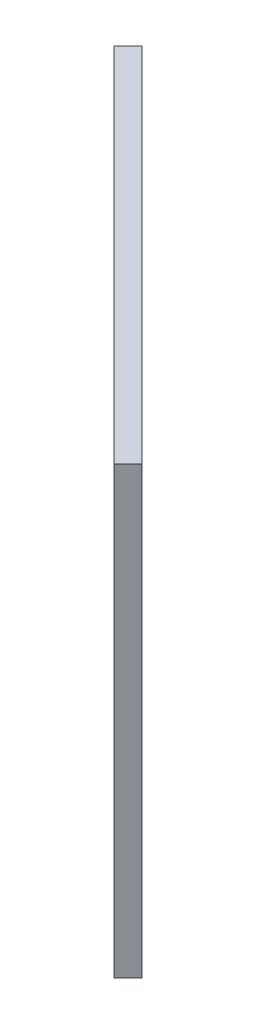
ISO-10303-21;
HEADER;
FILE_DESCRIPTION(('STEP AP214'),'2;1');
FILE_NAME('part.step','',(''),(''),'','','');
FILE_SCHEMA(('AUTOMOTIVE_DESIGN { 1 0 10303 214 1 1 1 1 }'));
ENDSEC;
DATA;
#1=APPLICATION_CONTEXT('core data for automotive mechanical design processes');
#2=APPLICATION_PROTOCOL_DEFINITION('international standard','automotive_design',2000,#1);
#3=PRODUCT_CONTEXT('',#1,'mechanical');
#4=PRODUCT('Part','Part','',(#3));
#5=PRODUCT_RELATED_PRODUCT_CATEGORY('part','',(#4));
#6=PRODUCT_DEFINITION_FORMATION('','',#4);
#7=PRODUCT_DEFINITION_CONTEXT('part definition',#1,'design');
#8=PRODUCT_DEFINITION('design','',#6,#7);
#9=PRODUCT_DEFINITION_SHAPE('','',#8);
#10=(LENGTH_UNIT() NAMED_UNIT(*) SI_UNIT(.MILLI.,.METRE.));
#11=(NAMED_UNIT(*) PLANE_ANGLE_UNIT() SI_UNIT($,.RADIAN.));
#12=(NAMED_UNIT(*) SI_UNIT($,.STERADIAN.) SOLID_ANGLE_UNIT());
#13=UNCERTAINTY_MEASURE_WITH_UNIT(LENGTH_MEASURE(1.E-05),#10,'distance_accuracy_value','');
#14=(GEOMETRIC_REPRESENTATION_CONTEXT(3) GLOBAL_UNCERTAINTY_ASSIGNED_CONTEXT((#13)) GLOBAL_UNIT_ASSIGNED_CONTEXT((#10,
#11,#12)) REPRESENTATION_CONTEXT('',''));
#15=CARTESIAN_POINT('',(0.,0.,0.));
#16=DIRECTION('',(0.,0.,1.));
#17=DIRECTION('',(1.,0.,0.));
#18=AXIS2_PLACEMENT_3D('',#15,#16,#17);
#19=CARTESIAN_POINT('',(5126.5684024777,40605.2777383533,-5126.56840247746));
#20=DIRECTION('',(0.,1.,0.));
#21=DIRECTION('',(0.,0.,1.));
#22=AXIS2_PLACEMENT_3D('',#19,#20,#21);
#23=PLANE('',#22);
#24=DIRECTION('',(-0.707106781186534,0.,-0.707106781186561));
#25=VECTOR('',#24,1.);
#26=CARTESIAN_POINT('',(5147.78160591336,40605.2777383533,-5147.78160591312));
#27=LINE('',#26,#25);
#28=CARTESIAN_POINT('',(-11231.5402348683,40605.2777383533,-21527.1034466954));
#29=VERTEX_POINT('',#28);
#30=CARTESIAN_POINT('',(-11337.6062520462,40605.2777383533,-21633.1694638734));
#31=VERTEX_POINT('',#30);
#32=EDGE_CURVE('E2017',#29,#31,#27,.T.);
#33=ORIENTED_EDGE('',*,*,#32,.F.);
#34=DIRECTION('',(0.707106781186561,0.,-0.707106781186534));
#35=VECTOR('',#34,1.);
#36=CARTESIAN_POINT('',(-11252.7534383039,40605.2777383533,-21505.8902432598));
#37=LINE('',#36,#35);
#38=CARTESIAN_POINT('',(-11235.0757687743,40605.2777383533,-21523.5679127893));
#39=VERTEX_POINT('',#38);
#40=EDGE_CURVE('E2130',#39,#29,#37,.T.);
#41=ORIENTED_EDGE('',*,*,#40,.F.);
#42=DIRECTION('',(-0.707106781186541,0.,-0.707106781186554));
#43=VECTOR('',#42,1.);
#44=CARTESIAN_POINT('',(5144.24607200736,40605.2777383533,-5144.24607200726));
#45=LINE('',#44,#43);
#46=CARTESIAN_POINT('',(-11341.1417859523,40605.2777383533,-21629.6339299673));
#47=VERTEX_POINT('',#46);
#48=EDGE_CURVE('E2002',#39,#47,#45,.T.);
#49=ORIENTED_EDGE('',*,*,#48,.T.);
#50=DIRECTION('',(0.707106781186561,0.,-0.707106781186534));
#51=VECTOR('',#50,1.);
#52=CARTESIAN_POINT('',(-11358.8194554818,40605.2777383533,-21611.9562604378));
#53=LINE('',#52,#51);
#54=EDGE_CURVE('E2131',#47,#31,#53,.T.);
#55=ORIENTED_EDGE('',*,*,#54,.T.);
#56=EDGE_LOOP('',(#33,#41,#49,#55));
#57=FACE_BOUND('',#56,.T.);
#58=ADVANCED_FACE('F1993',(#57),#23,.F.);
#59=CARTESIAN_POINT('',(-11252.7534383038,40601.9277383533,-21505.8902432598));
#60=DIRECTION('',(0.707106781186561,0.,-0.707106781186534));
#61=DIRECTION('',(-0.707106781186534,0.,-0.707106781186561));
#62=AXIS2_PLACEMENT_3D('',#59,#60,#61);
#63=CYLINDRICAL_SURFACE('',#62,3.34999999999752);
#64=CARTESIAN_POINT('',(-11231.5402348682,40601.9277383533,-21527.1034466954));
#65=DIRECTION('',(0.707106781186561,0.,-0.707106781186534));
#66=DIRECTION('',(-0.707106781186534,0.,-0.707106781186561));
#67=AXIS2_PLACEMENT_3D('',#64,#65,#66);
#68=CIRCLE('',#67,3.34999999999752);
#69=CARTESIAN_POINT('',(-11231.5402348683,40598.5777383533,-21527.1034466954));
#70=VERTEX_POINT('',#69);
#71=EDGE_CURVE('E2127',#70,#29,#68,.F.);
#72=ORIENTED_EDGE('',*,*,#71,.F.);
#73=DIRECTION('',(0.707106781186561,0.,-0.707106781186534));
#74=VECTOR('',#73,1.);
#75=CARTESIAN_POINT('',(-11252.7534383039,40598.5777383533,-21505.8902432598));
#76=LINE('',#75,#74);
#77=CARTESIAN_POINT('',(-11235.0757687743,40598.5777383533,-21523.5679127893));
#78=VERTEX_POINT('',#77);
#79=EDGE_CURVE('E2138',#78,#70,#76,.T.);
#80=ORIENTED_EDGE('',*,*,#79,.F.);
#81=CARTESIAN_POINT('',(-11235.0757687743,40601.9277383533,-21523.5679127893));
#82=DIRECTION('',(-0.707106781186555,0.,0.707106781186541));
#83=DIRECTION('',(0.707106781186541,0.,0.707106781186554));
#84=AXIS2_PLACEMENT_3D('',#81,#82,#83);
#85=CIRCLE('',#84,3.34999999999752);
#86=EDGE_CURVE('E2177',#78,#39,#85,.T.);
#87=ORIENTED_EDGE('',*,*,#86,.T.);
#88=ORIENTED_EDGE('',*,*,#40,.T.);
#89=EDGE_LOOP('',(#72,#80,#87,#88));
#90=FACE_BOUND('',#89,.T.);
#91=ADVANCED_FACE('F2231',(#90),#63,.F.);
#92=CARTESIAN_POINT('',(5126.5684024777,40598.5777383533,-5126.56840247746));
#93=DIRECTION('',(0.,1.,0.));
#94=DIRECTION('',(0.,0.,1.));
#95=AXIS2_PLACEMENT_3D('',#92,#93,#94);
#96=PLANE('',#95);
#97=ORIENTED_EDGE('',*,*,#79,.T.);
#98=DIRECTION('',(-0.707106781186534,0.,-0.707106781186561));
#99=VECTOR('',#98,1.);
#100=CARTESIAN_POINT('',(5147.78160591336,40598.5777383533,-5147.78160591312));
#101=LINE('',#100,#99);
#102=CARTESIAN_POINT('',(-11337.6062520462,40598.5777383533,-21633.1694638734));
#103=VERTEX_POINT('',#102);
#104=EDGE_CURVE('E2121',#70,#103,#101,.T.);
#105=ORIENTED_EDGE('',*,*,#104,.T.);
#106=DIRECTION('',(0.707106781186561,0.,-0.707106781186534));
#107=VECTOR('',#106,1.);
#108=CARTESIAN_POINT('',(-11358.8194554818,40598.5777383533,-21611.9562604378));
#109=LINE('',#108,#107);
#110=CARTESIAN_POINT('',(-11341.1417859523,40598.5777383533,-21629.6339299673));
#111=VERTEX_POINT('',#110);
#112=EDGE_CURVE('E2135',#111,#103,#109,.T.);
#113=ORIENTED_EDGE('',*,*,#112,.F.);
#114=DIRECTION('',(-0.707106781186541,0.,-0.707106781186554));
#115=VECTOR('',#114,1.);
#116=CARTESIAN_POINT('',(5144.24607200736,40598.5777383533,-5144.24607200726));
#117=LINE('',#116,#115);
#118=EDGE_CURVE('E2174',#78,#111,#117,.T.);
#119=ORIENTED_EDGE('',*,*,#118,.F.);
#120=EDGE_LOOP('',(#97,#105,#113,#119));
#121=FACE_BOUND('',#120,.T.);
#122=ADVANCED_FACE('F2237',(#121),#96,.T.);
#123=CARTESIAN_POINT('',(-11358.8194554818,40601.9277383533,-21611.9562604378));
#124=DIRECTION('',(0.707106781186561,0.,-0.707106781186534));
#125=DIRECTION('',(-0.707106781186534,0.,-0.707106781186561));
#126=AXIS2_PLACEMENT_3D('',#123,#124,#125);
#127=CYLINDRICAL_SURFACE('',#126,3.34999999999752);
#128=CARTESIAN_POINT('',(-11337.6062520462,40601.9277383533,-21633.1694638734));
#129=DIRECTION('',(0.707106781186561,0.,-0.707106781186534));
#130=DIRECTION('',(-0.707106781186534,0.,-0.707106781186561));
#131=AXIS2_PLACEMENT_3D('',#128,#129,#130);
#132=CIRCLE('',#131,3.34999999999752);
#133=EDGE_CURVE('E12',#31,#103,#132,.F.);
#134=ORIENTED_EDGE('',*,*,#133,.F.);
#135=ORIENTED_EDGE('',*,*,#54,.F.);
#136=CARTESIAN_POINT('',(-11341.1417859523,40601.9277383533,-21629.6339299673));
#137=DIRECTION('',(-0.707106781186555,0.,0.707106781186541));
#138=DIRECTION('',(0.707106781186541,0.,0.707106781186554));
#139=AXIS2_PLACEMENT_3D('',#136,#137,#138);
#140=CIRCLE('',#139,3.34999999999752);
#141=EDGE_CURVE('E2172',#47,#111,#140,.T.);
#142=ORIENTED_EDGE('',*,*,#141,.T.);
#143=ORIENTED_EDGE('',*,*,#112,.T.);
#144=EDGE_LOOP('',(#134,#135,#142,#143));
#145=FACE_BOUND('',#144,.T.);
#146=ADVANCED_FACE('F2243',(#145),#127,.F.);
#147=CARTESIAN_POINT('',(-11372.7759132726,40621.9277383533,-21675.4101929113));
#148=DIRECTION('',(0.707106781186541,0.,0.707106781186554));
#149=DIRECTION('',(0.707106781186554,0.,-0.707106781186541));
#150=AXIS2_PLACEMENT_3D('',#147,#148,#149);
#151=PLANE('',#150);
#152=DIRECTION('',(0.,1.,0.));
#153=VECTOR('',#152,1.);
#154=CARTESIAN_POINT('',(-11379.8469810845,40621.9277383533,-21668.3391250994));
#155=LINE('',#154,#153);
#156=CARTESIAN_POINT('',(-11379.8469810845,40398.2797239448,-21668.3391250994));
#157=VERTEX_POINT('',#156);
#158=CARTESIAN_POINT('',(-11379.8469810845,40621.9277383533,-21668.3391250994));
#159=VERTEX_POINT('',#158);
#160=EDGE_CURVE('E2134',#157,#159,#155,.T.);
#161=ORIENTED_EDGE('',*,*,#160,.T.);
#162=DIRECTION('',(-0.707106781186554,0.,0.707106781186541));
#163=VECTOR('',#162,1.);
#164=CARTESIAN_POINT('',(-11372.7759132726,40621.9277383533,-21675.4101929113));
#165=LINE('',#164,#163);
#166=CARTESIAN_POINT('',(-11372.7759132726,40621.9277383533,-21675.4101929113));
#167=VERTEX_POINT('',#166);
#168=EDGE_CURVE('E2169',#167,#159,#165,.T.);
#169=ORIENTED_EDGE('',*,*,#168,.F.);
#170=DIRECTION('',(0.,1.,0.));
#171=VECTOR('',#170,1.);
#172=CARTESIAN_POINT('',(-11372.7759132726,40621.9277383533,-21675.4101929113));
#173=LINE('',#172,#171);
#174=CARTESIAN_POINT('',(-11372.7759132726,40398.2797239448,-21675.4101929113));
#175=VERTEX_POINT('',#174);
#176=EDGE_CURVE('E2143',#175,#167,#173,.T.);
#177=ORIENTED_EDGE('',*,*,#176,.F.);
#178=DIRECTION('',(-0.707106781186554,0.,0.707106781186541));
#179=VECTOR('',#178,1.);
#180=CARTESIAN_POINT('',(-11372.7759132726,40398.2797239448,-21675.4101929113));
#181=LINE('',#180,#179);
#182=EDGE_CURVE('E2153',#175,#157,#181,.T.);
#183=ORIENTED_EDGE('',*,*,#182,.T.);
#184=EDGE_LOOP('',(#161,#169,#177,#183));
#185=FACE_BOUND('',#184,.T.);
#186=ADVANCED_FACE('F1995',(#185),#151,.F.);
#187=CARTESIAN_POINT('',(-11372.7759132726,40621.9277383533,-21675.4101929113));
#188=DIRECTION('',(0.,-1.,0.));
#189=DIRECTION('',(1.,0.,0.));
#190=AXIS2_PLACEMENT_3D('',#187,#188,#189);
#191=PLANE('',#190);
#192=DIRECTION('',(0.707106781186541,0.,0.707106781186554));
#193=VECTOR('',#192,1.);
#194=CARTESIAN_POINT('',(-11379.8469810845,40621.9277383533,-21668.3391250994));
#195=LINE('',#194,#193);
#196=CARTESIAN_POINT('',(-11198.1145610634,40621.9277383533,-21486.6067050783));
#197=VERTEX_POINT('',#196);
#198=EDGE_CURVE('E2156',#159,#197,#195,.T.);
#199=ORIENTED_EDGE('',*,*,#198,.T.);
#200=DIRECTION('',(-0.707106781186554,0.,0.707106781186541));
#201=VECTOR('',#200,1.);
#202=CARTESIAN_POINT('',(-11191.0434932515,40621.9277383533,-21493.6777728902));
#203=LINE('',#202,#201);
#204=CARTESIAN_POINT('',(-11191.0434932515,40621.9277383533,-21493.6777728902));
#205=VERTEX_POINT('',#204);
#206=EDGE_CURVE('E2166',#205,#197,#203,.T.);
#207=ORIENTED_EDGE('',*,*,#206,.F.);
#208=DIRECTION('',(0.707106781186541,0.,0.707106781186554));
#209=VECTOR('',#208,1.);
#210=CARTESIAN_POINT('',(-11372.7759132726,40621.9277383533,-21675.4101929113));
#211=LINE('',#210,#209);
#212=EDGE_CURVE('E2146',#167,#205,#211,.T.);
#213=ORIENTED_EDGE('',*,*,#212,.F.);
#214=ORIENTED_EDGE('',*,*,#168,.T.);
#215=EDGE_LOOP('',(#199,#207,#213,#214));
#216=FACE_BOUND('',#215,.T.);
#217=ADVANCED_FACE('F2211',(#216),#191,.F.);
#218=CARTESIAN_POINT('',(-11191.0434932515,40621.9277383533,-21493.6777728902));
#219=DIRECTION('',(-0.707106781186541,0.,-0.707106781186554));
#220=DIRECTION('',(-0.707106781186554,0.,0.707106781186541));
#221=AXIS2_PLACEMENT_3D('',#218,#219,#220);
#222=PLANE('',#221);
#223=DIRECTION('',(0.,-1.,0.));
#224=VECTOR('',#223,1.);
#225=CARTESIAN_POINT('',(-11198.1145610634,40621.9277383533,-21486.6067050783));
#226=LINE('',#225,#224);
#227=CARTESIAN_POINT('',(-11198.1145610634,40398.2797239448,-21486.6067050783));
#228=VERTEX_POINT('',#227);
#229=EDGE_CURVE('E2158',#197,#228,#226,.T.);
#230=ORIENTED_EDGE('',*,*,#229,.T.);
#231=DIRECTION('',(-0.707106781186554,0.,0.707106781186541));
#232=VECTOR('',#231,1.);
#233=CARTESIAN_POINT('',(-11191.0434932515,40398.2797239448,-21493.6777728902));
#234=LINE('',#233,#232);
#235=CARTESIAN_POINT('',(-11191.0434932515,40398.2797239448,-21493.6777728902));
#236=VERTEX_POINT('',#235);
#237=EDGE_CURVE('E2163',#236,#228,#234,.T.);
#238=ORIENTED_EDGE('',*,*,#237,.F.);
#239=DIRECTION('',(0.,-1.,0.));
#240=VECTOR('',#239,1.);
#241=CARTESIAN_POINT('',(-11191.0434932515,40621.9277383533,-21493.6777728902));
#242=LINE('',#241,#240);
#243=EDGE_CURVE('E2149',#205,#236,#242,.T.);
#244=ORIENTED_EDGE('',*,*,#243,.F.);
#245=ORIENTED_EDGE('',*,*,#206,.T.);
#246=EDGE_LOOP('',(#230,#238,#244,#245));
#247=FACE_BOUND('',#246,.T.);
#248=ADVANCED_FACE('F2216',(#247),#222,.F.);
#249=CARTESIAN_POINT('',(-11372.7759132726,40398.2797239448,-21675.4101929113));
#250=DIRECTION('',(0.,1.,0.));
#251=DIRECTION('',(-1.,0.,0.));
#252=AXIS2_PLACEMENT_3D('',#249,#250,#251);
#253=PLANE('',#252);
#254=DIRECTION('',(-0.707106781186541,0.,-0.707106781186554));
#255=VECTOR('',#254,1.);
#256=CARTESIAN_POINT('',(-11379.8469810845,40398.2797239448,-21668.3391250994));
#257=LINE('',#256,#255);
#258=EDGE_CURVE('E2147',#228,#157,#257,.T.);
#259=ORIENTED_EDGE('',*,*,#258,.T.);
#260=ORIENTED_EDGE('',*,*,#182,.F.);
#261=DIRECTION('',(-0.707106781186541,0.,-0.707106781186554));
#262=VECTOR('',#261,1.);
#263=CARTESIAN_POINT('',(-11372.7759132726,40398.2797239448,-21675.4101929113));
#264=LINE('',#263,#262);
#265=EDGE_CURVE('E2151',#236,#175,#264,.T.);
#266=ORIENTED_EDGE('',*,*,#265,.F.);
#267=ORIENTED_EDGE('',*,*,#237,.T.);
#268=EDGE_LOOP('',(#259,#260,#266,#267));
#269=FACE_BOUND('',#268,.T.);
#270=ADVANCED_FACE('F2198',(#269),#253,.F.);
#271=CARTESIAN_POINT('',(5151.31713981922,0.,-5151.31713981912));
#272=DIRECTION('',(-0.707106781186555,0.,0.707106781186541));
#273=DIRECTION('',(0.707106781186541,0.,0.707106781186554));
#274=AXIS2_PLACEMENT_3D('',#271,#272,#273);
#275=PLANE('',#274);
#276=CARTESIAN_POINT('',(-11312.2902913736,40485.1634413215,-21614.9245710126));
#277=DIRECTION('',(0.707106781186561,0.,-0.707106781186534));
#278=DIRECTION('',(-0.707106781186534,0.,-0.707106781186561));
#279=AXIS2_PLACEMENT_3D('',#276,#277,#278);
#280=CIRCLE('',#279,3.35000000000109);
#281=CARTESIAN_POINT('',(-11314.6590990906,40485.1634413215,-21617.2933787296));
#282=VERTEX_POINT('',#281);
#283=EDGE_CURVE('E2186',#282,#282,#280,.T.);
#284=ORIENTED_EDGE('',*,*,#283,.F.);
#285=EDGE_LOOP('',(#284));
#286=FACE_BOUND('',#285,.T.);
#287=CARTESIAN_POINT('',(-11291.077087938,40485.1634413215,-21593.711367577));
#288=DIRECTION('',(0.707106781186561,0.,-0.707106781186534));
#289=DIRECTION('',(-0.707106781186534,0.,-0.707106781186561));
#290=AXIS2_PLACEMENT_3D('',#287,#288,#289);
#291=CIRCLE('',#290,3.50000000000107);
#292=CARTESIAN_POINT('',(-11293.5519616722,40485.1634413215,-21596.1862413112));
#293=VERTEX_POINT('',#292);
#294=EDGE_CURVE('E2109',#293,#293,#291,.T.);
#295=ORIENTED_EDGE('',*,*,#294,.F.);
#296=EDGE_LOOP('',(#295));
#297=FACE_BOUND('',#296,.T.);
#298=DIRECTION('',(0.707106781186536,0.,0.707106781186559));
#299=VECTOR('',#298,1.);
#300=CARTESIAN_POINT('',(-11334.0707181403,40606.9277383533,-21636.7049977793));
#301=LINE('',#300,#299);
#302=CARTESIAN_POINT('',(-11334.0707181406,40606.9277383533,-21636.7049977793));
#303=VERTEX_POINT('',#302);
#304=CARTESIAN_POINT('',(-11228.0047009623,40606.9277383533,-21530.6389806013));
#305=VERTEX_POINT('',#304);
#306=EDGE_CURVE('E2115',#303,#305,#301,.T.);
#307=ORIENTED_EDGE('',*,*,#306,.F.);
#308=CARTESIAN_POINT('',(-11334.0707181403,40601.9277383533,-21636.7049977793));
#309=DIRECTION('',(0.707106781186561,0.,-0.707106781186534));
#310=DIRECTION('',(-0.707106781186534,0.,-0.707106781186561));
#311=AXIS2_PLACEMENT_3D('',#308,#309,#310);
#312=CIRCLE('',#311,5.00000000000256);
#313=CARTESIAN_POINT('',(-11334.0707181403,40596.9277383533,-21636.7049977793));
#314=VERTEX_POINT('',#313);
#315=EDGE_CURVE('E2010',#314,#303,#312,.T.);
#316=ORIENTED_EDGE('',*,*,#315,.F.);
#317=DIRECTION('',(-0.707106781186536,0.,-0.707106781186559));
#318=VECTOR('',#317,1.);
#319=CARTESIAN_POINT('',(-11334.0707181403,40596.9277383533,-21636.7049977793));
#320=LINE('',#319,#318);
#321=CARTESIAN_POINT('',(-11228.0047009623,40596.9277383533,-21530.6389806013));
#322=VERTEX_POINT('',#321);
#323=EDGE_CURVE('E2103',#322,#314,#320,.T.);
#324=ORIENTED_EDGE('',*,*,#323,.F.);
#325=CARTESIAN_POINT('',(-11228.0047009623,40601.9277383533,-21530.6389806013));
#326=DIRECTION('',(0.707106781186561,0.,-0.707106781186534));
#327=DIRECTION('',(-0.707106781186534,0.,-0.707106781186561));
#328=AXIS2_PLACEMENT_3D('',#325,#326,#327);
#329=CIRCLE('',#328,5.00000000000256);
#330=EDGE_CURVE('E2106',#305,#322,#329,.T.);
#331=ORIENTED_EDGE('',*,*,#330,.F.);
#332=EDGE_LOOP('',(#307,#316,#324,#331));
#333=FACE_BOUND('',#332,.T.);
#334=ORIENTED_EDGE('',*,*,#176,.T.);
#335=ORIENTED_EDGE('',*,*,#212,.T.);
#336=ORIENTED_EDGE('',*,*,#243,.T.);
#337=ORIENTED_EDGE('',*,*,#265,.T.);
#338=EDGE_LOOP('',(#334,#335,#336,#337));
#339=FACE_BOUND('',#338,.T.);
#340=ADVANCED_FACE('F2194',(#286,#297,#333,#339),#275,.F.);
#341=CARTESIAN_POINT('',(5144.24607200736,0.,-5144.24607200726));
#342=DIRECTION('',(-0.707106781186555,0.,0.707106781186541));
#343=DIRECTION('',(0.707106781186541,0.,0.707106781186554));
#344=AXIS2_PLACEMENT_3D('',#341,#342,#343);
#345=PLANE('',#344);
#346=CARTESIAN_POINT('',(-11319.3613591856,40485.1634413215,-21607.8535032006));
#347=DIRECTION('',(-0.707106781186555,0.,0.707106781186541));
#348=DIRECTION('',(0.707106781186541,0.,0.707106781186554));
#349=AXIS2_PLACEMENT_3D('',#346,#347,#348);
#350=CIRCLE('',#349,3.35000000000109);
#351=CARTESIAN_POINT('',(-11316.9925514687,40485.1634413215,-21605.4846954836));
#352=VERTEX_POINT('',#351);
#353=EDGE_CURVE('E1997',#352,#352,#350,.T.);
#354=ORIENTED_EDGE('',*,*,#353,.F.);
#355=EDGE_LOOP('',(#354));
#356=FACE_BOUND('',#355,.T.);
#357=CARTESIAN_POINT('',(-11298.14815575,40485.1634413215,-21586.640299765));
#358=DIRECTION('',(-0.707106781186555,0.,0.707106781186541));
#359=DIRECTION('',(0.707106781186541,0.,0.707106781186554));
#360=AXIS2_PLACEMENT_3D('',#357,#358,#359);
#361=CIRCLE('',#360,3.50000000000107);
#362=CARTESIAN_POINT('',(-11295.6732820159,40485.1634413215,-21584.1654260308));
#363=VERTEX_POINT('',#362);
#364=EDGE_CURVE('E2180',#363,#363,#361,.T.);
#365=ORIENTED_EDGE('',*,*,#364,.F.);
#366=EDGE_LOOP('',(#365));
#367=FACE_BOUND('',#366,.T.);
#368=ORIENTED_EDGE('',*,*,#48,.F.);
#369=ORIENTED_EDGE('',*,*,#86,.F.);
#370=ORIENTED_EDGE('',*,*,#118,.T.);
#371=ORIENTED_EDGE('',*,*,#141,.F.);
#372=EDGE_LOOP('',(#368,#369,#370,#371));
#373=FACE_BOUND('',#372,.T.);
#374=ORIENTED_EDGE('',*,*,#160,.F.);
#375=ORIENTED_EDGE('',*,*,#258,.F.);
#376=ORIENTED_EDGE('',*,*,#229,.F.);
#377=ORIENTED_EDGE('',*,*,#198,.F.);
#378=EDGE_LOOP('',(#374,#375,#376,#377));
#379=FACE_BOUND('',#378,.T.);
#380=ADVANCED_FACE('F2197',(#356,#367,#373,#379),#345,.T.);
#381=CARTESIAN_POINT('',(-11337.6062520462,40601.9277383533,-21633.1694638734));
#382=DIRECTION('',(0.707106781186561,0.,-0.707106781186534));
#383=DIRECTION('',(-0.707106781186534,0.,-0.707106781186561));
#384=AXIS2_PLACEMENT_3D('',#381,#382,#383);
#385=PLANE('',#384);
#386=CARTESIAN_POINT('',(-11337.6062520462,40601.9277383533,-21633.1694638734));
#387=DIRECTION('',(0.707106781186561,0.,-0.707106781186534));
#388=DIRECTION('',(-0.707106781186534,0.,-0.707106781186561));
#389=AXIS2_PLACEMENT_3D('',#386,#387,#388);
#390=CIRCLE('',#389,5.00000000000256);
#391=CARTESIAN_POINT('',(-11337.6062520462,40596.9277383533,-21633.1694638734));
#392=VERTEX_POINT('',#391);
#393=CARTESIAN_POINT('',(-11337.6062520462,40606.9277383533,-21633.1694638734));
#394=VERTEX_POINT('',#393);
#395=EDGE_CURVE('E2085',#392,#394,#390,.T.);
#396=ORIENTED_EDGE('',*,*,#395,.T.);
#397=DIRECTION('',(0.707106781186536,0.,0.707106781186559));
#398=VECTOR('',#397,1.);
#399=CARTESIAN_POINT('',(-11337.6062520462,40606.9277383533,-21633.1694638734));
#400=LINE('',#399,#398);
#401=CARTESIAN_POINT('',(-11231.5402348683,40606.9277383533,-21527.1034466954));
#402=VERTEX_POINT('',#401);
#403=EDGE_CURVE('E2094',#394,#402,#400,.T.);
#404=ORIENTED_EDGE('',*,*,#403,.T.);
#405=CARTESIAN_POINT('',(-11231.5402348683,40601.9277383533,-21527.1034466954));
#406=DIRECTION('',(0.707106781186561,0.,-0.707106781186534));
#407=DIRECTION('',(-0.707106781186534,0.,-0.707106781186561));
#408=AXIS2_PLACEMENT_3D('',#405,#406,#407);
#409=CIRCLE('',#408,5.00000000000256);
#410=CARTESIAN_POINT('',(-11231.5402348683,40596.9277383533,-21527.1034466954));
#411=VERTEX_POINT('',#410);
#412=EDGE_CURVE('E2099',#402,#411,#409,.T.);
#413=ORIENTED_EDGE('',*,*,#412,.T.);
#414=DIRECTION('',(-0.707106781186536,0.,-0.707106781186559));
#415=VECTOR('',#414,1.);
#416=CARTESIAN_POINT('',(-11337.6062520462,40596.9277383533,-21633.1694638734));
#417=LINE('',#416,#415);
#418=EDGE_CURVE('E2091',#411,#392,#417,.T.);
#419=ORIENTED_EDGE('',*,*,#418,.T.);
#420=EDGE_LOOP('',(#396,#404,#413,#419));
#421=FACE_BOUND('',#420,.T.);
#422=ORIENTED_EDGE('',*,*,#32,.T.);
#423=ORIENTED_EDGE('',*,*,#133,.T.);
#424=ORIENTED_EDGE('',*,*,#104,.F.);
#425=ORIENTED_EDGE('',*,*,#71,.T.);
#426=EDGE_LOOP('',(#422,#423,#424,#425));
#427=FACE_BOUND('',#426,.T.);
#428=ADVANCED_FACE('F2101',(#421,#427),#385,.T.);
#429=CARTESIAN_POINT('',(-11337.6062520462,40601.9277383533,-21633.1694638734));
#430=DIRECTION('',(0.707106781186561,0.,-0.707106781186534));
#431=DIRECTION('',(-0.707106781186534,0.,-0.707106781186561));
#432=AXIS2_PLACEMENT_3D('',#429,#430,#431);
#433=CYLINDRICAL_SURFACE('',#432,5.00000000000256);
#434=ORIENTED_EDGE('',*,*,#315,.T.);
#435=DIRECTION('',(0.707106781186561,0.,-0.707106781186534));
#436=VECTOR('',#435,1.);
#437=CARTESIAN_POINT('',(-11337.6062520462,40606.9277383533,-21633.1694638734));
#438=LINE('',#437,#436);
#439=EDGE_CURVE('E2081',#394,#303,#438,.T.);
#440=ORIENTED_EDGE('',*,*,#439,.F.);
#441=ORIENTED_EDGE('',*,*,#395,.F.);
#442=DIRECTION('',(0.707106781186561,0.,-0.707106781186534));
#443=VECTOR('',#442,1.);
#444=CARTESIAN_POINT('',(-11337.6062520462,40596.9277383533,-21633.1694638734));
#445=LINE('',#444,#443);
#446=EDGE_CURVE('E2119',#392,#314,#445,.T.);
#447=ORIENTED_EDGE('',*,*,#446,.T.);
#448=EDGE_LOOP('',(#434,#440,#441,#447));
#449=FACE_BOUND('',#448,.T.);
#450=ADVANCED_FACE('F2083',(#449),#433,.F.);
#451=CARTESIAN_POINT('',(-11337.6062520462,40596.9277383533,-21633.1694638734));
#452=DIRECTION('',(0.,-1.,0.));
#453=DIRECTION('',(0.,0.,-1.));
#454=AXIS2_PLACEMENT_3D('',#451,#452,#453);
#455=PLANE('',#454);
#456=ORIENTED_EDGE('',*,*,#323,.T.);
#457=ORIENTED_EDGE('',*,*,#446,.F.);
#458=ORIENTED_EDGE('',*,*,#418,.F.);
#459=DIRECTION('',(0.707106781186561,0.,-0.707106781186534));
#460=VECTOR('',#459,1.);
#461=CARTESIAN_POINT('',(-11231.5402348683,40596.9277383533,-21527.1034466954));
#462=LINE('',#461,#460);
#463=EDGE_CURVE('E2122',#411,#322,#462,.T.);
#464=ORIENTED_EDGE('',*,*,#463,.T.);
#465=EDGE_LOOP('',(#456,#457,#458,#464));
#466=FACE_BOUND('',#465,.T.);
#467=ADVANCED_FACE('F2250',(#466),#455,.F.);
#468=CARTESIAN_POINT('',(-11231.5402348683,40601.9277383533,-21527.1034466954));
#469=DIRECTION('',(0.707106781186561,0.,-0.707106781186534));
#470=DIRECTION('',(-0.707106781186534,0.,-0.707106781186561));
#471=AXIS2_PLACEMENT_3D('',#468,#469,#470);
#472=CYLINDRICAL_SURFACE('',#471,5.00000000000256);
#473=ORIENTED_EDGE('',*,*,#330,.T.);
#474=ORIENTED_EDGE('',*,*,#463,.F.);
#475=ORIENTED_EDGE('',*,*,#412,.F.);
#476=DIRECTION('',(0.707106781186561,0.,-0.707106781186534));
#477=VECTOR('',#476,1.);
#478=CARTESIAN_POINT('',(-11231.5402348683,40606.9277383533,-21527.1034466954));
#479=LINE('',#478,#477);
#480=EDGE_CURVE('E2090',#402,#305,#479,.T.);
#481=ORIENTED_EDGE('',*,*,#480,.T.);
#482=EDGE_LOOP('',(#473,#474,#475,#481));
#483=FACE_BOUND('',#482,.T.);
#484=ADVANCED_FACE('F2254',(#483),#472,.F.);
#485=CARTESIAN_POINT('',(-11337.6062520462,40606.9277383533,-21633.1694638734));
#486=DIRECTION('',(0.,1.,0.));
#487=DIRECTION('',(0.,0.,1.));
#488=AXIS2_PLACEMENT_3D('',#485,#486,#487);
#489=PLANE('',#488);
#490=ORIENTED_EDGE('',*,*,#306,.T.);
#491=ORIENTED_EDGE('',*,*,#480,.F.);
#492=ORIENTED_EDGE('',*,*,#403,.F.);
#493=ORIENTED_EDGE('',*,*,#439,.T.);
#494=EDGE_LOOP('',(#490,#491,#492,#493));
#495=FACE_BOUND('',#494,.T.);
#496=ADVANCED_FACE('F2095',(#495),#489,.F.);
#497=CARTESIAN_POINT('',(-11389.0143657606,40485.1634413215,-21495.7740897544));
#498=DIRECTION('',(0.707106781186561,0.,-0.707106781186534));
#499=DIRECTION('',(-0.707106781186534,0.,-0.707106781186561));
#500=AXIS2_PLACEMENT_3D('',#497,#498,#499);
#501=CYLINDRICAL_SURFACE('',#500,3.50000000000107);
#502=ORIENTED_EDGE('',*,*,#364,.T.);
#503=EDGE_LOOP('',(#502));
#504=FACE_BOUND('',#503,.T.);
#505=ORIENTED_EDGE('',*,*,#294,.T.);
#506=EDGE_LOOP('',(#505));
#507=FACE_BOUND('',#506,.T.);
#508=ADVANCED_FACE('F2253',(#504,#507),#501,.F.);
#509=CARTESIAN_POINT('',(-11410.2275691962,40485.1634413215,-21516.98729319));
#510=DIRECTION('',(0.707106781186561,0.,-0.707106781186534));
#511=DIRECTION('',(-0.707106781186534,0.,-0.707106781186561));
#512=AXIS2_PLACEMENT_3D('',#509,#510,#511);
#513=CYLINDRICAL_SURFACE('',#512,3.35000000000109);
#514=ORIENTED_EDGE('',*,*,#353,.T.);
#515=EDGE_LOOP('',(#514));
#516=FACE_BOUND('',#515,.T.);
#517=ORIENTED_EDGE('',*,*,#283,.T.);
#518=EDGE_LOOP('',(#517));
#519=FACE_BOUND('',#518,.T.);
#520=ADVANCED_FACE('F2192',(#516,#519),#513,.F.);
#521=CLOSED_SHELL('',(#58,#91,#122,#146,#186,#217,#248,#270,#340,#380,#428,#450,#467,#484,#496,
#508,#520));
#522=MANIFOLD_SOLID_BREP('B2',#521);
#523=ADVANCED_BREP_SHAPE_REPRESENTATION('',(#18,#522),#14);
#524=SHAPE_DEFINITION_REPRESENTATION(#9,#523);
ENDSEC;
END-ISO-10303-21;
